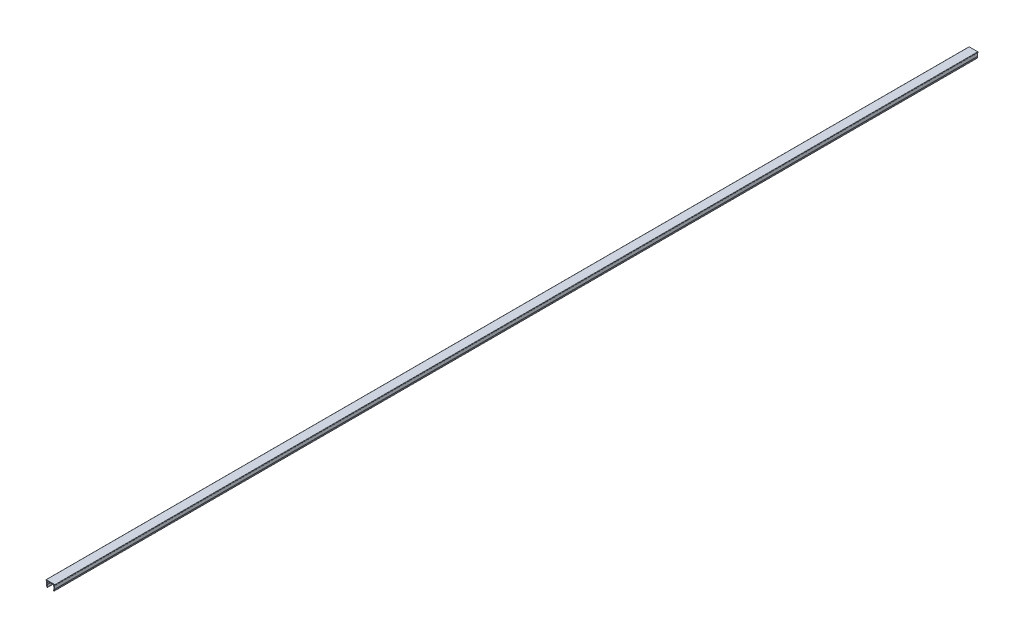
ISO-10303-21;
HEADER;
FILE_DESCRIPTION(('STEP AP214'),'2;1');
FILE_NAME('part.step','',(''),(''),'','','');
FILE_SCHEMA(('AUTOMOTIVE_DESIGN { 1 0 10303 214 1 1 1 1 }'));
ENDSEC;
DATA;
#1=APPLICATION_CONTEXT('core data for automotive mechanical design processes');
#2=APPLICATION_PROTOCOL_DEFINITION('international standard','automotive_design',2000,#1);
#3=PRODUCT_CONTEXT('',#1,'mechanical');
#4=PRODUCT('Part','Part','',(#3));
#5=PRODUCT_RELATED_PRODUCT_CATEGORY('part','',(#4));
#6=PRODUCT_DEFINITION_FORMATION('','',#4);
#7=PRODUCT_DEFINITION_CONTEXT('part definition',#1,'design');
#8=PRODUCT_DEFINITION('design','',#6,#7);
#9=PRODUCT_DEFINITION_SHAPE('','',#8);
#10=(LENGTH_UNIT() NAMED_UNIT(*) SI_UNIT(.MILLI.,.METRE.));
#11=(NAMED_UNIT(*) PLANE_ANGLE_UNIT() SI_UNIT($,.RADIAN.));
#12=(NAMED_UNIT(*) SI_UNIT($,.STERADIAN.) SOLID_ANGLE_UNIT());
#13=UNCERTAINTY_MEASURE_WITH_UNIT(LENGTH_MEASURE(1.E-05),#10,'distance_accuracy_value','');
#14=(GEOMETRIC_REPRESENTATION_CONTEXT(3) GLOBAL_UNCERTAINTY_ASSIGNED_CONTEXT((#13)) GLOBAL_UNIT_ASSIGNED_CONTEXT((#10,
#11,#12)) REPRESENTATION_CONTEXT('',''));
#15=CARTESIAN_POINT('',(0.,0.,0.));
#16=DIRECTION('',(0.,0.,1.));
#17=DIRECTION('',(1.,0.,0.));
#18=AXIS2_PLACEMENT_3D('',#15,#16,#17);
#19=CARTESIAN_POINT('',(10.2713852397371,91.3687019791235,1000.));
#20=DIRECTION('',(0.,0.,-1.));
#21=DIRECTION('',(-1.,0.,0.));
#22=AXIS2_PLACEMENT_3D('',#19,#20,#21);
#23=CYLINDRICAL_SURFACE('',#22,0.350000000000003);
#24=CARTESIAN_POINT('',(10.2713852397371,91.3687019791235,0.));
#25=DIRECTION('',(0.,0.,-1.));
#26=DIRECTION('',(1.,0.,0.));
#27=AXIS2_PLACEMENT_3D('',#24,#25,#26);
#28=CIRCLE('',#27,0.350000000000003);
#29=CARTESIAN_POINT('',(10.6160679532914,91.429478841307,0.));
#30=VERTEX_POINT('',#29);
#31=CARTESIAN_POINT('',(10.6002776570121,91.2489949289594,0.));
#32=VERTEX_POINT('',#31);
#33=EDGE_CURVE('E229',#30,#32,#28,.T.);
#34=ORIENTED_EDGE('',*,*,#33,.T.);
#35=DIRECTION('',(0.,0.,-1.));
#36=VECTOR('',#35,1.);
#37=CARTESIAN_POINT('',(10.6002776570121,91.2489949289594,1000.));
#38=LINE('',#37,#36);
#39=CARTESIAN_POINT('',(10.6002776570121,91.2489949289594,1000.));
#40=VERTEX_POINT('',#39);
#41=EDGE_CURVE('E11',#40,#32,#38,.T.);
#42=ORIENTED_EDGE('',*,*,#41,.F.);
#43=CARTESIAN_POINT('',(10.2713852397371,91.3687019791235,1000.));
#44=DIRECTION('',(0.,0.,-1.));
#45=DIRECTION('',(1.,0.,0.));
#46=AXIS2_PLACEMENT_3D('',#43,#44,#45);
#47=CIRCLE('',#46,0.350000000000003);
#48=CARTESIAN_POINT('',(10.6160679532914,91.429478841307,1000.));
#49=VERTEX_POINT('',#48);
#50=EDGE_CURVE('E275',#49,#40,#47,.T.);
#51=ORIENTED_EDGE('',*,*,#50,.F.);
#52=DIRECTION('',(0.,0.,-1.));
#53=VECTOR('',#52,1.);
#54=CARTESIAN_POINT('',(10.6160679532914,91.429478841307,1000.));
#55=LINE('',#54,#53);
#56=EDGE_CURVE('E225',#49,#30,#55,.T.);
#57=ORIENTED_EDGE('',*,*,#56,.T.);
#58=EDGE_LOOP('',(#34,#42,#51,#57));
#59=FACE_BOUND('',#58,.T.);
#60=ADVANCED_FACE('F37',(#59),#23,.F.);
#61=CARTESIAN_POINT('',(9.95762548116702,89.4833225872592,1000.));
#62=DIRECTION('',(0.939692620786055,-0.342020143325267,0.));
#63=DIRECTION('',(0.342020143325267,0.939692620786055,0.));
#64=AXIS2_PLACEMENT_3D('',#61,#62,#63);
#65=PLANE('',#64);
#66=DIRECTION('',(-0.342020143325266,-0.939692620786055,0.));
#67=VECTOR('',#66,1.);
#68=CARTESIAN_POINT('',(9.95762548116702,89.4833225872592,0.));
#69=LINE('',#68,#67);
#70=CARTESIAN_POINT('',(9.95762548116702,89.4833225872592,0.));
#71=VERTEX_POINT('',#70);
#72=EDGE_CURVE('E232',#32,#71,#69,.T.);
#73=ORIENTED_EDGE('',*,*,#72,.T.);
#74=DIRECTION('',(0.,0.,-1.));
#75=VECTOR('',#74,1.);
#76=CARTESIAN_POINT('',(9.95762548116702,89.4833225872592,1000.));
#77=LINE('',#76,#75);
#78=CARTESIAN_POINT('',(9.95762548116702,89.4833225872592,1000.));
#79=VERTEX_POINT('',#78);
#80=EDGE_CURVE('E45',#79,#71,#77,.T.);
#81=ORIENTED_EDGE('',*,*,#80,.F.);
#82=DIRECTION('',(-0.342020143325266,-0.939692620786055,0.));
#83=VECTOR('',#82,1.);
#84=CARTESIAN_POINT('',(9.95762548116702,89.4833225872592,1000.));
#85=LINE('',#84,#83);
#86=EDGE_CURVE('E144',#40,#79,#85,.T.);
#87=ORIENTED_EDGE('',*,*,#86,.F.);
#88=ORIENTED_EDGE('',*,*,#41,.T.);
#89=EDGE_LOOP('',(#73,#81,#87,#88));
#90=FACE_BOUND('',#89,.T.);
#91=ADVANCED_FACE('F413',(#90),#65,.F.);
#92=CARTESIAN_POINT('',(10.3335025294815,89.3465145299291,1000.));
#93=DIRECTION('',(0.,0.,-1.));
#94=DIRECTION('',(-1.,0.,0.));
#95=AXIS2_PLACEMENT_3D('',#92,#93,#94);
#96=CYLINDRICAL_SURFACE('',#95,0.400000000000089);
#97=CARTESIAN_POINT('',(10.3335025294815,89.3465145299291,0.));
#98=DIRECTION('',(0.,0.,1.));
#99=DIRECTION('',(1.,0.,0.));
#100=AXIS2_PLACEMENT_3D('',#97,#98,#99);
#101=CIRCLE('',#100,0.400000000000089);
#102=CARTESIAN_POINT('',(10.7093795777959,89.2097064725987,0.));
#103=VERTEX_POINT('',#102);
#104=EDGE_CURVE('E234',#71,#103,#101,.T.);
#105=ORIENTED_EDGE('',*,*,#104,.T.);
#106=DIRECTION('',(0.,0.,-1.));
#107=VECTOR('',#106,1.);
#108=CARTESIAN_POINT('',(10.7093795777959,89.2097064725987,1000.));
#109=LINE('',#108,#107);
#110=CARTESIAN_POINT('',(10.7093795777959,89.2097064725987,1000.));
#111=VERTEX_POINT('',#110);
#112=EDGE_CURVE('E330',#111,#103,#109,.T.);
#113=ORIENTED_EDGE('',*,*,#112,.F.);
#114=CARTESIAN_POINT('',(10.3335025294815,89.3465145299291,1000.));
#115=DIRECTION('',(0.,0.,1.));
#116=DIRECTION('',(1.,0.,0.));
#117=AXIS2_PLACEMENT_3D('',#114,#115,#116);
#118=CIRCLE('',#117,0.400000000000089);
#119=EDGE_CURVE('E338',#79,#111,#118,.T.);
#120=ORIENTED_EDGE('',*,*,#119,.F.);
#121=ORIENTED_EDGE('',*,*,#80,.T.);
#122=EDGE_LOOP('',(#105,#113,#120,#121));
#123=FACE_BOUND('',#122,.T.);
#124=ADVANCED_FACE('F336',(#123),#96,.T.);
#125=CARTESIAN_POINT('',(11.3666417451915,91.0155194361756,1000.));
#126=DIRECTION('',(-0.939692620785643,0.342020143326397,0.));
#127=DIRECTION('',(-0.342020143326397,-0.939692620785643,0.));
#128=AXIS2_PLACEMENT_3D('',#125,#126,#127);
#129=PLANE('',#128);
#130=DIRECTION('',(0.342020143326397,0.939692620785643,0.));
#131=VECTOR('',#130,1.);
#132=CARTESIAN_POINT('',(11.3666417451915,91.0155194361756,0.));
#133=LINE('',#132,#131);
#134=CARTESIAN_POINT('',(11.3666417451915,91.0155194361756,0.));
#135=VERTEX_POINT('',#134);
#136=EDGE_CURVE('E236',#103,#135,#133,.T.);
#137=ORIENTED_EDGE('',*,*,#136,.T.);
#138=DIRECTION('',(0.,0.,-1.));
#139=VECTOR('',#138,1.);
#140=CARTESIAN_POINT('',(11.3666417451915,91.0155194361756,1000.));
#141=LINE('',#140,#139);
#142=CARTESIAN_POINT('',(11.3666417451915,91.0155194361756,1000.));
#143=VERTEX_POINT('',#142);
#144=EDGE_CURVE('E327',#143,#135,#141,.T.);
#145=ORIENTED_EDGE('',*,*,#144,.F.);
#146=DIRECTION('',(0.342020143326397,0.939692620785643,0.));
#147=VECTOR('',#146,1.);
#148=CARTESIAN_POINT('',(11.3666417451915,91.0155194361756,1000.));
#149=LINE('',#148,#147);
#150=EDGE_CURVE('E356',#111,#143,#149,.T.);
#151=ORIENTED_EDGE('',*,*,#150,.F.);
#152=ORIENTED_EDGE('',*,*,#112,.T.);
#153=EDGE_LOOP('',(#137,#145,#151,#152));
#154=FACE_BOUND('',#153,.T.);
#155=ADVANCED_FACE('F347',(#154),#129,.F.);
#156=CARTESIAN_POINT('',(10.4269491244062,91.3575395795018,1000.));
#157=DIRECTION('',(0.,0.,-1.));
#158=DIRECTION('',(-1.,0.,0.));
#159=AXIS2_PLACEMENT_3D('',#156,#157,#158);
#160=CYLINDRICAL_SURFACE('',#159,0.999999999999184);
#161=CARTESIAN_POINT('',(10.4269491244062,91.3575395795018,0.));
#162=DIRECTION('',(0.,0.,1.));
#163=DIRECTION('',(1.,0.,0.));
#164=AXIS2_PLACEMENT_3D('',#161,#162,#163);
#165=CIRCLE('',#164,0.999999999999184);
#166=CARTESIAN_POINT('',(11.4117568774176,91.5311877571688,0.));
#167=VERTEX_POINT('',#166);
#168=EDGE_CURVE('E238',#135,#167,#165,.T.);
#169=ORIENTED_EDGE('',*,*,#168,.T.);
#170=DIRECTION('',(0.,0.,-1.));
#171=VECTOR('',#170,1.);
#172=CARTESIAN_POINT('',(11.4117568774176,91.5311877571688,1000.));
#173=LINE('',#172,#171);
#174=CARTESIAN_POINT('',(11.4117568774176,91.5311877571688,1000.));
#175=VERTEX_POINT('',#174);
#176=EDGE_CURVE('E324',#175,#167,#173,.T.);
#177=ORIENTED_EDGE('',*,*,#176,.F.);
#178=CARTESIAN_POINT('',(10.4269491244062,91.3575395795018,1000.));
#179=DIRECTION('',(0.,0.,1.));
#180=DIRECTION('',(1.,0.,0.));
#181=AXIS2_PLACEMENT_3D('',#178,#179,#180);
#182=CIRCLE('',#181,0.999999999999184);
#183=EDGE_CURVE('E353',#143,#175,#182,.T.);
#184=ORIENTED_EDGE('',*,*,#183,.F.);
#185=ORIENTED_EDGE('',*,*,#144,.T.);
#186=EDGE_LOOP('',(#169,#177,#184,#185));
#187=FACE_BOUND('',#186,.T.);
#188=ADVANCED_FACE('F351',(#187),#160,.T.);
#189=CARTESIAN_POINT('',(10.8266626811092,94.8494218354426,1000.));
#190=DIRECTION('',(-0.984807753012109,-0.17364817766749,0.));
#191=DIRECTION('',(0.17364817766749,-0.984807753012109,0.));
#192=AXIS2_PLACEMENT_3D('',#189,#190,#191);
#193=PLANE('',#192);
#194=DIRECTION('',(-0.17364817766749,0.984807753012109,0.));
#195=VECTOR('',#194,1.);
#196=CARTESIAN_POINT('',(10.8266626811092,94.8494218354426,0.));
#197=LINE('',#196,#195);
#198=CARTESIAN_POINT('',(10.8266626811092,94.8494218354426,0.));
#199=VERTEX_POINT('',#198);
#200=EDGE_CURVE('E240',#167,#199,#197,.T.);
#201=ORIENTED_EDGE('',*,*,#200,.T.);
#202=DIRECTION('',(0.,0.,-1.));
#203=VECTOR('',#202,1.);
#204=CARTESIAN_POINT('',(10.8266626811092,94.8494218354426,1000.));
#205=LINE('',#204,#203);
#206=CARTESIAN_POINT('',(10.8266626811092,94.8494218354426,1000.));
#207=VERTEX_POINT('',#206);
#208=EDGE_CURVE('E321',#207,#199,#205,.T.);
#209=ORIENTED_EDGE('',*,*,#208,.F.);
#210=DIRECTION('',(-0.17364817766749,0.984807753012109,0.));
#211=VECTOR('',#210,1.);
#212=CARTESIAN_POINT('',(10.8266626811092,94.8494218354426,1000.));
#213=LINE('',#212,#211);
#214=EDGE_CURVE('E355',#175,#207,#213,.T.);
#215=ORIENTED_EDGE('',*,*,#214,.F.);
#216=ORIENTED_EDGE('',*,*,#176,.T.);
#217=EDGE_LOOP('',(#201,#209,#215,#216));
#218=FACE_BOUND('',#217,.T.);
#219=ADVANCED_FACE('F426',(#218),#193,.F.);
#220=CARTESIAN_POINT('',(11.5114970697512,94.8494218354426,1000.));
#221=DIRECTION('',(0.,1.,0.));
#222=DIRECTION('',(0.,0.,1.));
#223=AXIS2_PLACEMENT_3D('',#220,#221,#222);
#224=PLANE('',#223);
#225=DIRECTION('',(1.,0.,0.));
#226=VECTOR('',#225,1.);
#227=CARTESIAN_POINT('',(11.5114970697512,94.8494218354426,0.));
#228=LINE('',#227,#226);
#229=CARTESIAN_POINT('',(11.5114970697512,94.8494218354426,0.));
#230=VERTEX_POINT('',#229);
#231=EDGE_CURVE('E242',#199,#230,#228,.T.);
#232=ORIENTED_EDGE('',*,*,#231,.T.);
#233=DIRECTION('',(0.,0.,-1.));
#234=VECTOR('',#233,1.);
#235=CARTESIAN_POINT('',(11.5114970697512,94.8494218354426,1000.));
#236=LINE('',#235,#234);
#237=CARTESIAN_POINT('',(11.5114970697512,94.8494218354426,1000.));
#238=VERTEX_POINT('',#237);
#239=EDGE_CURVE('E318',#238,#230,#236,.T.);
#240=ORIENTED_EDGE('',*,*,#239,.F.);
#241=DIRECTION('',(1.,0.,0.));
#242=VECTOR('',#241,1.);
#243=CARTESIAN_POINT('',(11.5114970697512,94.8494218354426,1000.));
#244=LINE('',#243,#242);
#245=EDGE_CURVE('E358',#207,#238,#244,.T.);
#246=ORIENTED_EDGE('',*,*,#245,.F.);
#247=ORIENTED_EDGE('',*,*,#208,.T.);
#248=EDGE_LOOP('',(#232,#240,#246,#247));
#249=FACE_BOUND('',#248,.T.);
#250=ADVANCED_FACE('F429',(#249),#224,.F.);
#251=CARTESIAN_POINT('',(11.5114970697512,95.0494218354432,1000.));
#252=DIRECTION('',(0.,0.,-1.));
#253=DIRECTION('',(-1.,0.,0.));
#254=AXIS2_PLACEMENT_3D('',#251,#252,#253);
#255=CYLINDRICAL_SURFACE('',#254,0.200000000000448);
#256=CARTESIAN_POINT('',(11.5114970697512,95.0494218354432,0.));
#257=DIRECTION('',(0.,0.,1.));
#258=DIRECTION('',(1.,0.,0.));
#259=AXIS2_PLACEMENT_3D('',#256,#257,#258);
#260=CIRCLE('',#259,0.200000000000448);
#261=CARTESIAN_POINT('',(11.7114970697516,95.0494218354434,0.));
#262=VERTEX_POINT('',#261);
#263=EDGE_CURVE('E244',#230,#262,#260,.T.);
#264=ORIENTED_EDGE('',*,*,#263,.T.);
#265=DIRECTION('',(0.,0.,-1.));
#266=VECTOR('',#265,1.);
#267=CARTESIAN_POINT('',(11.7114970697516,95.0494218354434,1000.));
#268=LINE('',#267,#266);
#269=CARTESIAN_POINT('',(11.7114970697516,95.0494218354434,1000.));
#270=VERTEX_POINT('',#269);
#271=EDGE_CURVE('E315',#270,#262,#268,.T.);
#272=ORIENTED_EDGE('',*,*,#271,.F.);
#273=CARTESIAN_POINT('',(11.5114970697512,95.0494218354432,1000.));
#274=DIRECTION('',(0.,0.,1.));
#275=DIRECTION('',(1.,0.,0.));
#276=AXIS2_PLACEMENT_3D('',#273,#274,#275);
#277=CIRCLE('',#276,0.200000000000448);
#278=EDGE_CURVE('E364',#238,#270,#277,.T.);
#279=ORIENTED_EDGE('',*,*,#278,.F.);
#280=ORIENTED_EDGE('',*,*,#239,.T.);
#281=EDGE_LOOP('',(#264,#272,#279,#280));
#282=FACE_BOUND('',#281,.T.);
#283=ADVANCED_FACE('F433',(#282),#255,.T.);
#284=CARTESIAN_POINT('',(11.7114970697512,95.3494218354426,1000.));
#285=DIRECTION('',(-1.,-1.2085240216001E-12,0.));
#286=DIRECTION('',(1.2085240216001E-12,-1.,0.));
#287=AXIS2_PLACEMENT_3D('',#284,#285,#286);
#288=PLANE('',#287);
#289=DIRECTION('',(-1.2085240216001E-12,1.,0.));
#290=VECTOR('',#289,1.);
#291=CARTESIAN_POINT('',(11.7114970697512,95.3494218354426,0.));
#292=LINE('',#291,#290);
#293=CARTESIAN_POINT('',(11.7114970697512,95.3494218354426,0.));
#294=VERTEX_POINT('',#293);
#295=EDGE_CURVE('E246',#262,#294,#292,.T.);
#296=ORIENTED_EDGE('',*,*,#295,.T.);
#297=DIRECTION('',(0.,0.,-1.));
#298=VECTOR('',#297,1.);
#299=CARTESIAN_POINT('',(11.7114970697512,95.3494218354426,1000.));
#300=LINE('',#299,#298);
#301=CARTESIAN_POINT('',(11.7114970697512,95.3494218354426,1000.));
#302=VERTEX_POINT('',#301);
#303=EDGE_CURVE('E312',#302,#294,#300,.T.);
#304=ORIENTED_EDGE('',*,*,#303,.F.);
#305=DIRECTION('',(-1.2085240216001E-12,1.,0.));
#306=VECTOR('',#305,1.);
#307=CARTESIAN_POINT('',(11.7114970697512,95.3494218354426,1000.));
#308=LINE('',#307,#306);
#309=EDGE_CURVE('E366',#270,#302,#308,.T.);
#310=ORIENTED_EDGE('',*,*,#309,.F.);
#311=ORIENTED_EDGE('',*,*,#271,.T.);
#312=EDGE_LOOP('',(#296,#304,#310,#311));
#313=FACE_BOUND('',#312,.T.);
#314=ADVANCED_FACE('F437',(#313),#288,.F.);
#315=CARTESIAN_POINT('',(11.4114970697519,95.3494218354426,1000.));
#316=DIRECTION('',(0.,0.,-1.));
#317=DIRECTION('',(-1.,0.,0.));
#318=AXIS2_PLACEMENT_3D('',#315,#316,#317);
#319=CYLINDRICAL_SURFACE('',#318,0.299999999999633);
#320=CARTESIAN_POINT('',(11.4114970697519,95.3494218354426,0.));
#321=DIRECTION('',(0.,0.,1.));
#322=DIRECTION('',(1.,0.,0.));
#323=AXIS2_PLACEMENT_3D('',#320,#321,#322);
#324=CIRCLE('',#323,0.299999999999633);
#325=CARTESIAN_POINT('',(11.4114970697519,95.6494218354423,0.));
#326=VERTEX_POINT('',#325);
#327=EDGE_CURVE('E248',#294,#326,#324,.T.);
#328=ORIENTED_EDGE('',*,*,#327,.T.);
#329=DIRECTION('',(0.,0.,-1.));
#330=VECTOR('',#329,1.);
#331=CARTESIAN_POINT('',(11.4114970697519,95.6494218354423,1000.));
#332=LINE('',#331,#330);
#333=CARTESIAN_POINT('',(11.4114970697519,95.6494218354423,1000.));
#334=VERTEX_POINT('',#333);
#335=EDGE_CURVE('E309',#334,#326,#332,.T.);
#336=ORIENTED_EDGE('',*,*,#335,.F.);
#337=CARTESIAN_POINT('',(11.4114970697519,95.3494218354426,1000.));
#338=DIRECTION('',(0.,0.,1.));
#339=DIRECTION('',(1.,0.,0.));
#340=AXIS2_PLACEMENT_3D('',#337,#338,#339);
#341=CIRCLE('',#340,0.299999999999633);
#342=EDGE_CURVE('E368',#302,#334,#341,.T.);
#343=ORIENTED_EDGE('',*,*,#342,.F.);
#344=ORIENTED_EDGE('',*,*,#303,.T.);
#345=EDGE_LOOP('',(#328,#336,#343,#344));
#346=FACE_BOUND('',#345,.T.);
#347=ADVANCED_FACE('F441',(#346),#319,.T.);
#348=CARTESIAN_POINT('',(2.2114970697512,95.6494218354419,1000.));
#349=DIRECTION('',(0.,-1.,0.));
#350=DIRECTION('',(1.,0.,0.));
#351=AXIS2_PLACEMENT_3D('',#348,#349,#350);
#352=PLANE('',#351);
#353=DIRECTION('',(-1.,0.,0.));
#354=VECTOR('',#353,1.);
#355=CARTESIAN_POINT('',(2.2114970697512,95.6494218354419,0.));
#356=LINE('',#355,#354);
#357=CARTESIAN_POINT('',(2.2114970697512,95.6494218354419,0.));
#358=VERTEX_POINT('',#357);
#359=EDGE_CURVE('E250',#326,#358,#356,.T.);
#360=ORIENTED_EDGE('',*,*,#359,.T.);
#361=DIRECTION('',(0.,0.,-1.));
#362=VECTOR('',#361,1.);
#363=CARTESIAN_POINT('',(2.2114970697512,95.6494218354419,1000.));
#364=LINE('',#363,#362);
#365=CARTESIAN_POINT('',(2.2114970697512,95.6494218354419,1000.));
#366=VERTEX_POINT('',#365);
#367=EDGE_CURVE('E306',#366,#358,#364,.T.);
#368=ORIENTED_EDGE('',*,*,#367,.F.);
#369=DIRECTION('',(-1.,0.,0.));
#370=VECTOR('',#369,1.);
#371=CARTESIAN_POINT('',(2.2114970697512,95.6494218354419,1000.));
#372=LINE('',#371,#370);
#373=EDGE_CURVE('E370',#334,#366,#372,.T.);
#374=ORIENTED_EDGE('',*,*,#373,.F.);
#375=ORIENTED_EDGE('',*,*,#335,.T.);
#376=EDGE_LOOP('',(#360,#368,#374,#375));
#377=FACE_BOUND('',#376,.T.);
#378=ADVANCED_FACE('F445',(#377),#352,.F.);
#379=CARTESIAN_POINT('',(2.2114970697512,95.3494218354426,1000.));
#380=DIRECTION('',(0.,0.,-1.));
#381=DIRECTION('',(-1.,0.,0.));
#382=AXIS2_PLACEMENT_3D('',#379,#380,#381);
#383=CYLINDRICAL_SURFACE('',#382,0.299999999999623);
#384=CARTESIAN_POINT('',(2.2114970697512,95.3494218354426,0.));
#385=DIRECTION('',(0.,0.,1.));
#386=DIRECTION('',(1.,0.,0.));
#387=AXIS2_PLACEMENT_3D('',#384,#385,#386);
#388=CIRCLE('',#387,0.299999999999623);
#389=CARTESIAN_POINT('',(1.91149706975158,95.3494218354426,0.));
#390=VERTEX_POINT('',#389);
#391=EDGE_CURVE('E252',#358,#390,#388,.T.);
#392=ORIENTED_EDGE('',*,*,#391,.T.);
#393=DIRECTION('',(0.,0.,-1.));
#394=VECTOR('',#393,1.);
#395=CARTESIAN_POINT('',(1.91149706975158,95.3494218354426,1000.));
#396=LINE('',#395,#394);
#397=CARTESIAN_POINT('',(1.91149706975158,95.3494218354426,1000.));
#398=VERTEX_POINT('',#397);
#399=EDGE_CURVE('E303',#398,#390,#396,.T.);
#400=ORIENTED_EDGE('',*,*,#399,.F.);
#401=CARTESIAN_POINT('',(2.2114970697512,95.3494218354426,1000.));
#402=DIRECTION('',(0.,0.,1.));
#403=DIRECTION('',(1.,0.,0.));
#404=AXIS2_PLACEMENT_3D('',#401,#402,#403);
#405=CIRCLE('',#404,0.299999999999623);
#406=EDGE_CURVE('E372',#366,#398,#405,.T.);
#407=ORIENTED_EDGE('',*,*,#406,.F.);
#408=ORIENTED_EDGE('',*,*,#367,.T.);
#409=EDGE_LOOP('',(#392,#400,#407,#408));
#410=FACE_BOUND('',#409,.T.);
#411=ADVANCED_FACE('F449',(#410),#383,.T.);
#412=CARTESIAN_POINT('',(1.91149706975193,95.0494218354434,1000.));
#413=DIRECTION('',(1.,2.42644446202844E-12,0.));
#414=DIRECTION('',(-2.42644446202844E-12,1.,0.));
#415=AXIS2_PLACEMENT_3D('',#412,#413,#414);
#416=PLANE('',#415);
#417=DIRECTION('',(2.42644446202844E-12,-1.,0.));
#418=VECTOR('',#417,1.);
#419=CARTESIAN_POINT('',(1.91149706975193,95.0494218354434,0.));
#420=LINE('',#419,#418);
#421=CARTESIAN_POINT('',(1.91149706975193,95.0494218354434,0.));
#422=VERTEX_POINT('',#421);
#423=EDGE_CURVE('E254',#390,#422,#420,.T.);
#424=ORIENTED_EDGE('',*,*,#423,.T.);
#425=DIRECTION('',(0.,0.,-1.));
#426=VECTOR('',#425,1.);
#427=CARTESIAN_POINT('',(1.91149706975193,95.0494218354434,1000.));
#428=LINE('',#427,#426);
#429=CARTESIAN_POINT('',(1.91149706975193,95.0494218354434,1000.));
#430=VERTEX_POINT('',#429);
#431=EDGE_CURVE('E300',#430,#422,#428,.T.);
#432=ORIENTED_EDGE('',*,*,#431,.F.);
#433=DIRECTION('',(2.42644446202844E-12,-1.,0.));
#434=VECTOR('',#433,1.);
#435=CARTESIAN_POINT('',(1.91149706975193,95.0494218354434,1000.));
#436=LINE('',#435,#434);
#437=EDGE_CURVE('E374',#398,#430,#436,.T.);
#438=ORIENTED_EDGE('',*,*,#437,.F.);
#439=ORIENTED_EDGE('',*,*,#399,.T.);
#440=EDGE_LOOP('',(#424,#432,#438,#439));
#441=FACE_BOUND('',#440,.T.);
#442=ADVANCED_FACE('F453',(#441),#416,.F.);
#443=CARTESIAN_POINT('',(2.11149706975266,95.0494218354434,1000.));
#444=DIRECTION('',(0.,0.,-1.));
#445=DIRECTION('',(-1.,0.,0.));
#446=AXIS2_PLACEMENT_3D('',#443,#444,#445);
#447=CYLINDRICAL_SURFACE('',#446,0.200000000000366);
#448=CARTESIAN_POINT('',(2.11149706975266,95.0494218354434,0.));
#449=DIRECTION('',(0.,0.,1.));
#450=DIRECTION('',(1.,0.,0.));
#451=AXIS2_PLACEMENT_3D('',#448,#449,#450);
#452=CIRCLE('',#451,0.200000000000366);
#453=CARTESIAN_POINT('',(2.11149706975266,94.849421835443,0.));
#454=VERTEX_POINT('',#453);
#455=EDGE_CURVE('E256',#422,#454,#452,.T.);
#456=ORIENTED_EDGE('',*,*,#455,.T.);
#457=DIRECTION('',(0.,0.,-1.));
#458=VECTOR('',#457,1.);
#459=CARTESIAN_POINT('',(2.11149706975266,94.849421835443,1000.));
#460=LINE('',#459,#458);
#461=CARTESIAN_POINT('',(2.11149706975266,94.849421835443,1000.));
#462=VERTEX_POINT('',#461);
#463=EDGE_CURVE('E297',#462,#454,#460,.T.);
#464=ORIENTED_EDGE('',*,*,#463,.F.);
#465=CARTESIAN_POINT('',(2.11149706975266,95.0494218354434,1000.));
#466=DIRECTION('',(0.,0.,1.));
#467=DIRECTION('',(1.,0.,0.));
#468=AXIS2_PLACEMENT_3D('',#465,#466,#467);
#469=CIRCLE('',#468,0.200000000000366);
#470=EDGE_CURVE('E376',#430,#462,#469,.T.);
#471=ORIENTED_EDGE('',*,*,#470,.F.);
#472=ORIENTED_EDGE('',*,*,#431,.T.);
#473=EDGE_LOOP('',(#456,#464,#471,#472));
#474=FACE_BOUND('',#473,.T.);
#475=ADVANCED_FACE('F457',(#474),#447,.T.);
#476=CARTESIAN_POINT('',(2.79472578035347,94.8494218354426,1000.));
#477=DIRECTION('',(1.05622751914473E-12,1.,0.));
#478=DIRECTION('',(-1.,1.05622751914473E-12,0.));
#479=AXIS2_PLACEMENT_3D('',#476,#477,#478);
#480=PLANE('',#479);
#481=DIRECTION('',(1.,-1.05622751914473E-12,0.));
#482=VECTOR('',#481,1.);
#483=CARTESIAN_POINT('',(2.79472578035347,94.8494218354426,0.));
#484=LINE('',#483,#482);
#485=CARTESIAN_POINT('',(2.79472578035347,94.8494218354426,0.));
#486=VERTEX_POINT('',#485);
#487=EDGE_CURVE('E258',#454,#486,#484,.T.);
#488=ORIENTED_EDGE('',*,*,#487,.T.);
#489=DIRECTION('',(0.,0.,-1.));
#490=VECTOR('',#489,1.);
#491=CARTESIAN_POINT('',(2.79472578035347,94.8494218354426,1000.));
#492=LINE('',#491,#490);
#493=CARTESIAN_POINT('',(2.79472578035347,94.8494218354426,1000.));
#494=VERTEX_POINT('',#493);
#495=EDGE_CURVE('E294',#494,#486,#492,.T.);
#496=ORIENTED_EDGE('',*,*,#495,.F.);
#497=DIRECTION('',(1.,-1.05622751914473E-12,0.));
#498=VECTOR('',#497,1.);
#499=CARTESIAN_POINT('',(2.79472578035347,94.8494218354426,1000.));
#500=LINE('',#499,#498);
#501=EDGE_CURVE('E378',#462,#494,#500,.T.);
#502=ORIENTED_EDGE('',*,*,#501,.F.);
#503=ORIENTED_EDGE('',*,*,#463,.T.);
#504=EDGE_LOOP('',(#488,#496,#502,#503));
#505=FACE_BOUND('',#504,.T.);
#506=ADVANCED_FACE('F461',(#505),#480,.F.);
#507=CARTESIAN_POINT('',(2.21119848781357,91.5400741100043,1000.));
#508=DIRECTION('',(0.984807753012263,-0.173648177666622,0.));
#509=DIRECTION('',(0.173648177666622,0.984807753012263,0.));
#510=AXIS2_PLACEMENT_3D('',#507,#508,#509);
#511=PLANE('',#510);
#512=DIRECTION('',(-0.173648177666622,-0.984807753012263,0.));
#513=VECTOR('',#512,1.);
#514=CARTESIAN_POINT('',(2.21119848781357,91.5400741100043,0.));
#515=LINE('',#514,#513);
#516=CARTESIAN_POINT('',(2.21119848781357,91.5400741100043,0.));
#517=VERTEX_POINT('',#516);
#518=EDGE_CURVE('E260',#486,#517,#515,.T.);
#519=ORIENTED_EDGE('',*,*,#518,.T.);
#520=DIRECTION('',(0.,0.,-1.));
#521=VECTOR('',#520,1.);
#522=CARTESIAN_POINT('',(2.21119848781357,91.5400741100043,1000.));
#523=LINE('',#522,#521);
#524=CARTESIAN_POINT('',(2.21119848781357,91.5400741100043,1000.));
#525=VERTEX_POINT('',#524);
#526=EDGE_CURVE('E291',#525,#517,#523,.T.);
#527=ORIENTED_EDGE('',*,*,#526,.F.);
#528=DIRECTION('',(-0.173648177666622,-0.984807753012263,0.));
#529=VECTOR('',#528,1.);
#530=CARTESIAN_POINT('',(2.21119848781357,91.5400741100043,1000.));
#531=LINE('',#530,#529);
#532=EDGE_CURVE('E380',#494,#525,#531,.T.);
#533=ORIENTED_EDGE('',*,*,#532,.F.);
#534=ORIENTED_EDGE('',*,*,#495,.T.);
#535=EDGE_LOOP('',(#519,#527,#533,#534));
#536=FACE_BOUND('',#535,.T.);
#537=ADVANCED_FACE('F465',(#536),#511,.F.);
#538=CARTESIAN_POINT('',(3.19600624082523,91.3664259323377,1000.));
#539=DIRECTION('',(0.,0.,-1.));
#540=DIRECTION('',(-1.,0.,0.));
#541=AXIS2_PLACEMENT_3D('',#538,#539,#540);
#542=CYLINDRICAL_SURFACE('',#541,0.999999999999692);
#543=CARTESIAN_POINT('',(3.19600624082523,91.3664259323377,0.));
#544=DIRECTION('',(0.,0.,1.));
#545=DIRECTION('',(1.,0.,0.));
#546=AXIS2_PLACEMENT_3D('',#543,#544,#545);
#547=CIRCLE('',#546,0.999999999999692);
#548=CARTESIAN_POINT('',(2.25631362003966,91.024405789012,0.));
#549=VERTEX_POINT('',#548);
#550=EDGE_CURVE('E262',#517,#549,#547,.T.);
#551=ORIENTED_EDGE('',*,*,#550,.T.);
#552=DIRECTION('',(0.,0.,-1.));
#553=VECTOR('',#552,1.);
#554=CARTESIAN_POINT('',(2.25631362003966,91.024405789012,1000.));
#555=LINE('',#554,#553);
#556=CARTESIAN_POINT('',(2.25631362003966,91.024405789012,1000.));
#557=VERTEX_POINT('',#556);
#558=EDGE_CURVE('E288',#557,#549,#555,.T.);
#559=ORIENTED_EDGE('',*,*,#558,.F.);
#560=CARTESIAN_POINT('',(3.19600624082523,91.3664259323377,1000.));
#561=DIRECTION('',(0.,0.,1.));
#562=DIRECTION('',(1.,0.,0.));
#563=AXIS2_PLACEMENT_3D('',#560,#561,#562);
#564=CIRCLE('',#563,0.999999999999692);
#565=EDGE_CURVE('E382',#525,#557,#564,.T.);
#566=ORIENTED_EDGE('',*,*,#565,.F.);
#567=ORIENTED_EDGE('',*,*,#526,.T.);
#568=EDGE_LOOP('',(#551,#559,#566,#567));
#569=FACE_BOUND('',#568,.T.);
#570=ADVANCED_FACE('F469',(#569),#542,.T.);
#571=CARTESIAN_POINT('',(2.91357578743232,89.2185928254355,1000.));
#572=DIRECTION('',(0.939692620786059,0.342020143325254,0.));
#573=DIRECTION('',(-0.342020143325254,0.939692620786059,0.));
#574=AXIS2_PLACEMENT_3D('',#571,#572,#573);
#575=PLANE('',#574);
#576=DIRECTION('',(0.342020143325254,-0.939692620786059,0.));
#577=VECTOR('',#576,1.);
#578=CARTESIAN_POINT('',(2.91357578743232,89.2185928254355,0.));
#579=LINE('',#578,#577);
#580=CARTESIAN_POINT('',(2.91357578743232,89.2185928254355,0.));
#581=VERTEX_POINT('',#580);
#582=EDGE_CURVE('E264',#549,#581,#579,.T.);
#583=ORIENTED_EDGE('',*,*,#582,.T.);
#584=DIRECTION('',(0.,0.,-1.));
#585=VECTOR('',#584,1.);
#586=CARTESIAN_POINT('',(2.91357578743232,89.2185928254355,1000.));
#587=LINE('',#586,#585);
#588=CARTESIAN_POINT('',(2.91357578743232,89.2185928254355,1000.));
#589=VERTEX_POINT('',#588);
#590=EDGE_CURVE('E285',#589,#581,#587,.T.);
#591=ORIENTED_EDGE('',*,*,#590,.F.);
#592=DIRECTION('',(0.342020143325254,-0.939692620786059,0.));
#593=VECTOR('',#592,1.);
#594=CARTESIAN_POINT('',(2.91357578743232,89.2185928254355,1000.));
#595=LINE('',#594,#593);
#596=EDGE_CURVE('E384',#557,#589,#595,.T.);
#597=ORIENTED_EDGE('',*,*,#596,.F.);
#598=ORIENTED_EDGE('',*,*,#558,.T.);
#599=EDGE_LOOP('',(#583,#591,#597,#598));
#600=FACE_BOUND('',#599,.T.);
#601=ADVANCED_FACE('F473',(#600),#575,.F.);
#602=CARTESIAN_POINT('',(3.28945283574892,89.3554008827664,1000.));
#603=DIRECTION('',(0.,0.,-1.));
#604=DIRECTION('',(-1.,0.,0.));
#605=AXIS2_PLACEMENT_3D('',#602,#603,#604);
#606=CYLINDRICAL_SURFACE('',#605,0.400000000001796);
#607=CARTESIAN_POINT('',(3.28945283574892,89.3554008827664,0.));
#608=DIRECTION('',(0.,0.,1.));
#609=DIRECTION('',(1.,0.,0.));
#610=AXIS2_PLACEMENT_3D('',#607,#608,#609);
#611=CIRCLE('',#610,0.400000000001796);
#612=CARTESIAN_POINT('',(3.66532988406495,89.4922089400974,0.));
#613=VERTEX_POINT('',#612);
#614=EDGE_CURVE('E266',#581,#613,#611,.T.);
#615=ORIENTED_EDGE('',*,*,#614,.T.);
#616=DIRECTION('',(0.,0.,-1.));
#617=VECTOR('',#616,1.);
#618=CARTESIAN_POINT('',(3.66532988406495,89.4922089400974,1000.));
#619=LINE('',#618,#617);
#620=CARTESIAN_POINT('',(3.66532988406495,89.4922089400974,1000.));
#621=VERTEX_POINT('',#620);
#622=EDGE_CURVE('E282',#621,#613,#619,.T.);
#623=ORIENTED_EDGE('',*,*,#622,.F.);
#624=CARTESIAN_POINT('',(3.28945283574892,89.3554008827664,1000.));
#625=DIRECTION('',(0.,0.,1.));
#626=DIRECTION('',(1.,0.,0.));
#627=AXIS2_PLACEMENT_3D('',#624,#625,#626);
#628=CIRCLE('',#627,0.400000000001796);
#629=EDGE_CURVE('E386',#589,#621,#628,.T.);
#630=ORIENTED_EDGE('',*,*,#629,.F.);
#631=ORIENTED_EDGE('',*,*,#590,.T.);
#632=EDGE_LOOP('',(#615,#623,#630,#631));
#633=FACE_BOUND('',#632,.T.);
#634=ADVANCED_FACE('F477',(#633),#606,.T.);
#635=CARTESIAN_POINT('',(3.02375937030229,91.2549094396418,1000.));
#636=DIRECTION('',(-0.939692620785604,-0.342020143326505,0.));
#637=DIRECTION('',(0.342020143326505,-0.939692620785604,0.));
#638=AXIS2_PLACEMENT_3D('',#635,#636,#637);
#639=PLANE('',#638);
#640=DIRECTION('',(-0.342020143326505,0.939692620785604,0.));
#641=VECTOR('',#640,1.);
#642=CARTESIAN_POINT('',(3.02375937030229,91.2549094396418,0.));
#643=LINE('',#642,#641);
#644=CARTESIAN_POINT('',(3.02375937030229,91.2549094396418,0.));
#645=VERTEX_POINT('',#644);
#646=EDGE_CURVE('E268',#613,#645,#643,.T.);
#647=ORIENTED_EDGE('',*,*,#646,.T.);
#648=DIRECTION('',(0.,0.,-1.));
#649=VECTOR('',#648,1.);
#650=CARTESIAN_POINT('',(3.02375937030229,91.2549094396418,1000.));
#651=LINE('',#650,#649);
#652=CARTESIAN_POINT('',(3.02375937030229,91.2549094396418,1000.));
#653=VERTEX_POINT('',#652);
#654=EDGE_CURVE('E279',#653,#645,#651,.T.);
#655=ORIENTED_EDGE('',*,*,#654,.F.);
#656=DIRECTION('',(-0.342020143326505,0.939692620785604,0.));
#657=VECTOR('',#656,1.);
#658=CARTESIAN_POINT('',(3.02375937030229,91.2549094396418,1000.));
#659=LINE('',#658,#657);
#660=EDGE_CURVE('E388',#621,#653,#659,.T.);
#661=ORIENTED_EDGE('',*,*,#660,.F.);
#662=ORIENTED_EDGE('',*,*,#622,.T.);
#663=EDGE_LOOP('',(#647,#655,#661,#662));
#664=FACE_BOUND('',#663,.T.);
#665=ADVANCED_FACE('F394',(#664),#639,.F.);
#666=CARTESIAN_POINT('',(3.3526517875772,91.3746164898061,1000.));
#667=DIRECTION('',(0.,0.,-1.));
#668=DIRECTION('',(-1.,0.,0.));
#669=AXIS2_PLACEMENT_3D('',#666,#667,#668);
#670=CYLINDRICAL_SURFACE('',#669,0.349999999999699);
#671=CARTESIAN_POINT('',(3.3526517875772,91.3746164898061,0.));
#672=DIRECTION('',(0.,0.,-1.));
#673=DIRECTION('',(1.,0.,0.));
#674=AXIS2_PLACEMENT_3D('',#671,#672,#673);
#675=CIRCLE('',#674,0.349999999999699);
#676=CARTESIAN_POINT('',(3.00796907402324,91.4353933519896,0.));
#677=VERTEX_POINT('',#676);
#678=EDGE_CURVE('E270',#645,#677,#675,.T.);
#679=ORIENTED_EDGE('',*,*,#678,.T.);
#680=DIRECTION('',(0.,0.,-1.));
#681=VECTOR('',#680,1.);
#682=CARTESIAN_POINT('',(3.00796907402324,91.4353933519896,1000.));
#683=LINE('',#682,#681);
#684=CARTESIAN_POINT('',(3.00796907402324,91.4353933519896,1000.));
#685=VERTEX_POINT('',#684);
#686=EDGE_CURVE('E220',#685,#677,#683,.T.);
#687=ORIENTED_EDGE('',*,*,#686,.F.);
#688=CARTESIAN_POINT('',(3.3526517875772,91.3746164898061,1000.));
#689=DIRECTION('',(0.,0.,-1.));
#690=DIRECTION('',(1.,0.,0.));
#691=AXIS2_PLACEMENT_3D('',#688,#689,#690);
#692=CIRCLE('',#691,0.349999999999699);
#693=EDGE_CURVE('E211',#653,#685,#692,.T.);
#694=ORIENTED_EDGE('',*,*,#693,.F.);
#695=ORIENTED_EDGE('',*,*,#654,.T.);
#696=EDGE_LOOP('',(#679,#687,#694,#695));
#697=FACE_BOUND('',#696,.T.);
#698=ADVANCED_FACE('F398',(#697),#670,.F.);
#699=CARTESIAN_POINT('',(3.60995440856434,94.8494218354429,1000.));
#700=DIRECTION('',(-0.984807753012168,0.173648177667157,0.));
#701=DIRECTION('',(-0.173648177667157,-0.984807753012168,0.));
#702=AXIS2_PLACEMENT_3D('',#699,#700,#701);
#703=PLANE('',#702);
#704=DIRECTION('',(0.173648177667157,0.984807753012168,0.));
#705=VECTOR('',#704,1.);
#706=CARTESIAN_POINT('',(3.60995440856434,94.8494218354429,0.));
#707=LINE('',#706,#705);
#708=CARTESIAN_POINT('',(3.60995440856434,94.8494218354429,0.));
#709=VERTEX_POINT('',#708);
#710=EDGE_CURVE('E219',#677,#709,#707,.T.);
#711=ORIENTED_EDGE('',*,*,#710,.T.);
#712=DIRECTION('',(0.,0.,-1.));
#713=VECTOR('',#712,1.);
#714=CARTESIAN_POINT('',(3.60995440856434,94.8494218354429,1000.));
#715=LINE('',#714,#713);
#716=CARTESIAN_POINT('',(3.60995440856434,94.8494218354429,1000.));
#717=VERTEX_POINT('',#716);
#718=EDGE_CURVE('E216',#717,#709,#715,.T.);
#719=ORIENTED_EDGE('',*,*,#718,.F.);
#720=DIRECTION('',(0.173648177667157,0.984807753012168,0.));
#721=VECTOR('',#720,1.);
#722=CARTESIAN_POINT('',(3.60995440856434,94.8494218354429,1000.));
#723=LINE('',#722,#721);
#724=EDGE_CURVE('E205',#685,#717,#723,.T.);
#725=ORIENTED_EDGE('',*,*,#724,.F.);
#726=ORIENTED_EDGE('',*,*,#686,.T.);
#727=EDGE_LOOP('',(#711,#719,#725,#726));
#728=FACE_BOUND('',#727,.T.);
#729=ADVANCED_FACE('F217',(#728),#703,.F.);
#730=CARTESIAN_POINT('',(10.0130397309419,94.8494218354429,1000.));
#731=DIRECTION('',(0.,1.,0.));
#732=DIRECTION('',(0.,0.,1.));
#733=AXIS2_PLACEMENT_3D('',#730,#731,#732);
#734=PLANE('',#733);
#735=DIRECTION('',(1.,0.,0.));
#736=VECTOR('',#735,1.);
#737=CARTESIAN_POINT('',(10.0130397309419,94.8494218354429,0.));
#738=LINE('',#737,#736);
#739=CARTESIAN_POINT('',(10.0130397309419,94.8494218354429,0.));
#740=VERTEX_POINT('',#739);
#741=EDGE_CURVE('E130',#709,#740,#738,.T.);
#742=ORIENTED_EDGE('',*,*,#741,.T.);
#743=DIRECTION('',(0.,0.,-1.));
#744=VECTOR('',#743,1.);
#745=CARTESIAN_POINT('',(10.0130397309419,94.8494218354429,1000.));
#746=LINE('',#745,#744);
#747=CARTESIAN_POINT('',(10.0130397309419,94.8494218354429,1000.));
#748=VERTEX_POINT('',#747);
#749=EDGE_CURVE('E221',#748,#740,#746,.T.);
#750=ORIENTED_EDGE('',*,*,#749,.F.);
#751=DIRECTION('',(1.,0.,0.));
#752=VECTOR('',#751,1.);
#753=CARTESIAN_POINT('',(10.0130397309419,94.8494218354429,1000.));
#754=LINE('',#753,#752);
#755=EDGE_CURVE('E209',#717,#748,#754,.T.);
#756=ORIENTED_EDGE('',*,*,#755,.F.);
#757=ORIENTED_EDGE('',*,*,#718,.T.);
#758=EDGE_LOOP('',(#742,#750,#756,#757));
#759=FACE_BOUND('',#758,.T.);
#760=ADVANCED_FACE('F223',(#759),#734,.F.);
#761=CARTESIAN_POINT('',(10.6160679532914,91.429478841307,1000.));
#762=DIRECTION('',(0.984807753012288,0.173648177666477,0.));
#763=DIRECTION('',(-0.173648177666477,0.984807753012288,0.));
#764=AXIS2_PLACEMENT_3D('',#761,#762,#763);
#765=PLANE('',#764);
#766=DIRECTION('',(0.173648177666477,-0.984807753012288,0.));
#767=VECTOR('',#766,1.);
#768=CARTESIAN_POINT('',(10.6160679532914,91.429478841307,0.));
#769=LINE('',#768,#767);
#770=EDGE_CURVE('E136',#740,#30,#769,.T.);
#771=ORIENTED_EDGE('',*,*,#770,.T.);
#772=ORIENTED_EDGE('',*,*,#56,.F.);
#773=DIRECTION('',(0.173648177666477,-0.984807753012288,0.));
#774=VECTOR('',#773,1.);
#775=CARTESIAN_POINT('',(10.6160679532914,91.429478841307,1000.));
#776=LINE('',#775,#774);
#777=EDGE_CURVE('E53',#748,#49,#776,.T.);
#778=ORIENTED_EDGE('',*,*,#777,.F.);
#779=ORIENTED_EDGE('',*,*,#749,.T.);
#780=EDGE_LOOP('',(#771,#772,#778,#779));
#781=FACE_BOUND('',#780,.T.);
#782=ADVANCED_FACE('F402',(#781),#765,.F.);
#783=CARTESIAN_POINT('',(10.2713852397371,91.3687019791235,1000.));
#784=DIRECTION('',(0.,0.,1.));
#785=DIRECTION('',(1.,0.,0.));
#786=AXIS2_PLACEMENT_3D('',#783,#784,#785);
#787=PLANE('',#786);
#788=ORIENTED_EDGE('',*,*,#50,.T.);
#789=ORIENTED_EDGE('',*,*,#86,.T.);
#790=ORIENTED_EDGE('',*,*,#119,.T.);
#791=ORIENTED_EDGE('',*,*,#150,.T.);
#792=ORIENTED_EDGE('',*,*,#183,.T.);
#793=ORIENTED_EDGE('',*,*,#214,.T.);
#794=ORIENTED_EDGE('',*,*,#245,.T.);
#795=ORIENTED_EDGE('',*,*,#278,.T.);
#796=ORIENTED_EDGE('',*,*,#309,.T.);
#797=ORIENTED_EDGE('',*,*,#342,.T.);
#798=ORIENTED_EDGE('',*,*,#373,.T.);
#799=ORIENTED_EDGE('',*,*,#406,.T.);
#800=ORIENTED_EDGE('',*,*,#437,.T.);
#801=ORIENTED_EDGE('',*,*,#470,.T.);
#802=ORIENTED_EDGE('',*,*,#501,.T.);
#803=ORIENTED_EDGE('',*,*,#532,.T.);
#804=ORIENTED_EDGE('',*,*,#565,.T.);
#805=ORIENTED_EDGE('',*,*,#596,.T.);
#806=ORIENTED_EDGE('',*,*,#629,.T.);
#807=ORIENTED_EDGE('',*,*,#660,.T.);
#808=ORIENTED_EDGE('',*,*,#693,.T.);
#809=ORIENTED_EDGE('',*,*,#724,.T.);
#810=ORIENTED_EDGE('',*,*,#755,.T.);
#811=ORIENTED_EDGE('',*,*,#777,.T.);
#812=EDGE_LOOP('',(#788,#789,#790,#791,#792,#793,#794,#795,#796,#797,#798,#799,#800,#801,#802,
#803,#804,#805,#806,#807,#808,#809,#810,#811));
#813=FACE_BOUND('',#812,.T.);
#814=ADVANCED_FACE('F207',(#813),#787,.T.);
#815=CARTESIAN_POINT('',(10.2713852397371,91.3687019791235,0.));
#816=DIRECTION('',(0.,0.,1.));
#817=DIRECTION('',(1.,0.,0.));
#818=AXIS2_PLACEMENT_3D('',#815,#816,#817);
#819=PLANE('',#818);
#820=ORIENTED_EDGE('',*,*,#33,.F.);
#821=ORIENTED_EDGE('',*,*,#770,.F.);
#822=ORIENTED_EDGE('',*,*,#741,.F.);
#823=ORIENTED_EDGE('',*,*,#710,.F.);
#824=ORIENTED_EDGE('',*,*,#678,.F.);
#825=ORIENTED_EDGE('',*,*,#646,.F.);
#826=ORIENTED_EDGE('',*,*,#614,.F.);
#827=ORIENTED_EDGE('',*,*,#582,.F.);
#828=ORIENTED_EDGE('',*,*,#550,.F.);
#829=ORIENTED_EDGE('',*,*,#518,.F.);
#830=ORIENTED_EDGE('',*,*,#487,.F.);
#831=ORIENTED_EDGE('',*,*,#455,.F.);
#832=ORIENTED_EDGE('',*,*,#423,.F.);
#833=ORIENTED_EDGE('',*,*,#391,.F.);
#834=ORIENTED_EDGE('',*,*,#359,.F.);
#835=ORIENTED_EDGE('',*,*,#327,.F.);
#836=ORIENTED_EDGE('',*,*,#295,.F.);
#837=ORIENTED_EDGE('',*,*,#263,.F.);
#838=ORIENTED_EDGE('',*,*,#231,.F.);
#839=ORIENTED_EDGE('',*,*,#200,.F.);
#840=ORIENTED_EDGE('',*,*,#168,.F.);
#841=ORIENTED_EDGE('',*,*,#136,.F.);
#842=ORIENTED_EDGE('',*,*,#104,.F.);
#843=ORIENTED_EDGE('',*,*,#72,.F.);
#844=EDGE_LOOP('',(#820,#821,#822,#823,#824,#825,#826,#827,#828,#829,#830,#831,#832,#833,#834,
#835,#836,#837,#838,#839,#840,#841,#842,#843));
#845=FACE_BOUND('',#844,.T.);
#846=ADVANCED_FACE('F342',(#845),#819,.F.);
#847=CLOSED_SHELL('',(#60,#91,#124,#155,#188,#219,#250,#283,#314,#347,#378,#411,#442,#475,#506,
#537,#570,#601,#634,#665,#698,#729,#760,#782,#814,#846));
#848=MANIFOLD_SOLID_BREP('B2',#847);
#849=ADVANCED_BREP_SHAPE_REPRESENTATION('',(#18,#848),#14);
#850=SHAPE_DEFINITION_REPRESENTATION(#9,#849);
ENDSEC;
END-ISO-10303-21;
